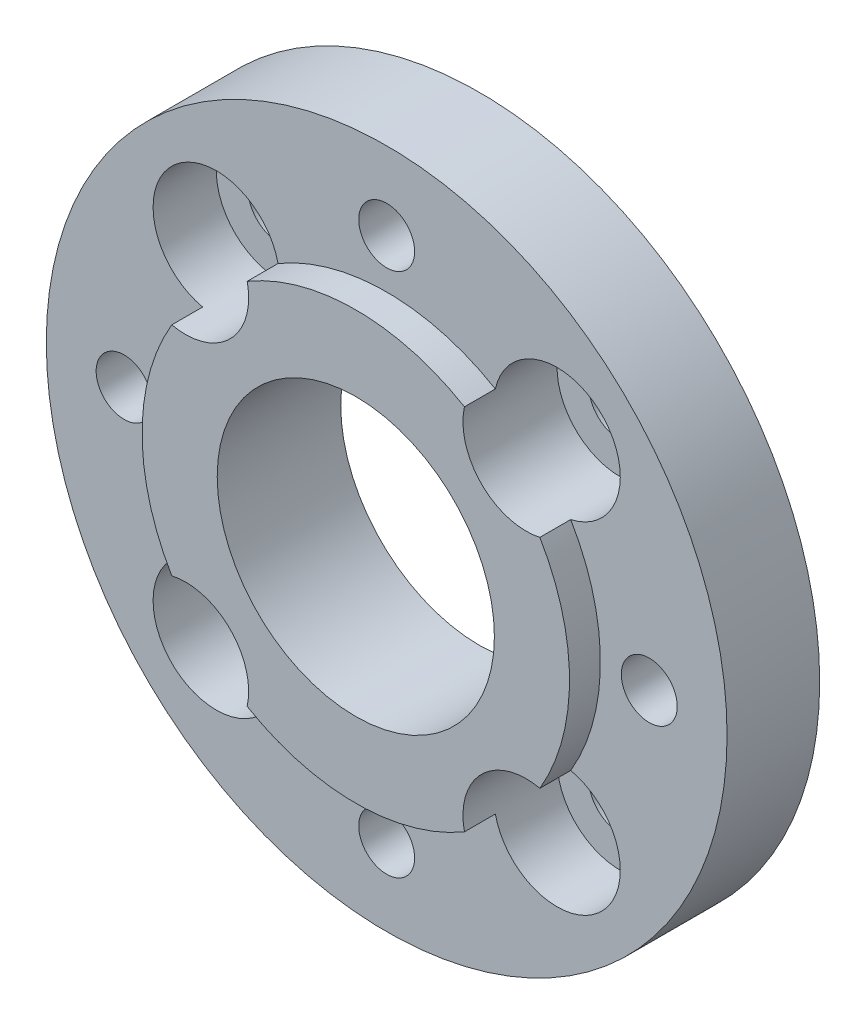
ISO-10303-21;
HEADER;
FILE_DESCRIPTION(('STEP AP214'),'2;1');
FILE_NAME('part.step','',(''),(''),'','','');
FILE_SCHEMA(('AUTOMOTIVE_DESIGN { 1 0 10303 214 1 1 1 1 }'));
ENDSEC;
DATA;
#1=APPLICATION_CONTEXT('core data for automotive mechanical design processes');
#2=APPLICATION_PROTOCOL_DEFINITION('international standard','automotive_design',2000,#1);
#3=PRODUCT_CONTEXT('',#1,'mechanical');
#4=PRODUCT('Part','Part','',(#3));
#5=PRODUCT_RELATED_PRODUCT_CATEGORY('part','',(#4));
#6=PRODUCT_DEFINITION_FORMATION('','',#4);
#7=PRODUCT_DEFINITION_CONTEXT('part definition',#1,'design');
#8=PRODUCT_DEFINITION('design','',#6,#7);
#9=PRODUCT_DEFINITION_SHAPE('','',#8);
#10=(LENGTH_UNIT() NAMED_UNIT(*) SI_UNIT(.MILLI.,.METRE.));
#11=(NAMED_UNIT(*) PLANE_ANGLE_UNIT() SI_UNIT($,.RADIAN.));
#12=(NAMED_UNIT(*) SI_UNIT($,.STERADIAN.) SOLID_ANGLE_UNIT());
#13=UNCERTAINTY_MEASURE_WITH_UNIT(LENGTH_MEASURE(1.E-05),#10,'distance_accuracy_value','');
#14=(GEOMETRIC_REPRESENTATION_CONTEXT(3) GLOBAL_UNCERTAINTY_ASSIGNED_CONTEXT((#13)) GLOBAL_UNIT_ASSIGNED_CONTEXT((#10,
#11,#12)) REPRESENTATION_CONTEXT('',''));
#15=CARTESIAN_POINT('',(0.,0.,0.));
#16=DIRECTION('',(0.,0.,1.));
#17=DIRECTION('',(1.,0.,0.));
#18=AXIS2_PLACEMENT_3D('',#15,#16,#17);
#19=CARTESIAN_POINT('',(35.0371410077935,-35.0371410077936,-19.05));
#20=DIRECTION('',(0.,0.,1.));
#21=DIRECTION('',(1.,0.,0.));
#22=AXIS2_PLACEMENT_3D('',#19,#20,#21);
#23=CYLINDRICAL_SURFACE('',#22,6.50000000000231);
#24=CARTESIAN_POINT('',(35.0371410077935,-35.0371410077936,-19.05));
#25=DIRECTION('',(0.,0.,1.));
#26=DIRECTION('',(1.,0.,0.));
#27=AXIS2_PLACEMENT_3D('',#24,#25,#26);
#28=CIRCLE('',#27,6.50000000000231);
#29=CARTESIAN_POINT('',(41.5371410077958,-35.0371410077936,-19.05));
#30=VERTEX_POINT('',#29);
#31=EDGE_CURVE('E590',#30,#30,#28,.T.);
#32=ORIENTED_EDGE('',*,*,#31,.F.);
#33=EDGE_LOOP('',(#32));
#34=FACE_BOUND('',#33,.T.);
#35=CARTESIAN_POINT('',(35.0371410077935,-35.0371410077936,-13.));
#36=DIRECTION('',(0.,0.,1.));
#37=DIRECTION('',(1.,0.,0.));
#38=AXIS2_PLACEMENT_3D('',#35,#36,#37);
#39=CIRCLE('',#38,6.50000000000231);
#40=CARTESIAN_POINT('',(41.5371410077958,-35.0371410077936,-13.));
#41=VERTEX_POINT('',#40);
#42=EDGE_CURVE('E41',#41,#41,#39,.F.);
#43=ORIENTED_EDGE('',*,*,#42,.F.);
#44=EDGE_LOOP('',(#43));
#45=FACE_BOUND('',#44,.T.);
#46=ADVANCED_FACE('F37',(#34,#45),#23,.F.);
#47=CARTESIAN_POINT('',(-35.0371410077955,-35.0371410077955,-19.05));
#48=DIRECTION('',(0.,0.,1.));
#49=DIRECTION('',(1.,0.,0.));
#50=AXIS2_PLACEMENT_3D('',#47,#48,#49);
#51=CYLINDRICAL_SURFACE('',#50,6.5);
#52=CARTESIAN_POINT('',(-35.0371410077955,-35.0371410077955,-19.05));
#53=DIRECTION('',(0.,0.,1.));
#54=DIRECTION('',(1.,0.,0.));
#55=AXIS2_PLACEMENT_3D('',#52,#53,#54);
#56=CIRCLE('',#55,6.5);
#57=CARTESIAN_POINT('',(-28.5371410077955,-35.0371410077955,-19.05));
#58=VERTEX_POINT('',#57);
#59=EDGE_CURVE('E586',#58,#58,#56,.T.);
#60=ORIENTED_EDGE('',*,*,#59,.F.);
#61=EDGE_LOOP('',(#60));
#62=FACE_BOUND('',#61,.T.);
#63=CARTESIAN_POINT('',(-35.0371410077955,-35.0371410077955,-13.));
#64=DIRECTION('',(0.,0.,1.));
#65=DIRECTION('',(1.,0.,0.));
#66=AXIS2_PLACEMENT_3D('',#63,#64,#65);
#67=CIRCLE('',#66,6.5);
#68=CARTESIAN_POINT('',(-28.5371410077955,-35.0371410077955,-13.));
#69=VERTEX_POINT('',#68);
#70=EDGE_CURVE('E259',#69,#69,#67,.F.);
#71=ORIENTED_EDGE('',*,*,#70,.F.);
#72=EDGE_LOOP('',(#71));
#73=FACE_BOUND('',#72,.T.);
#74=ADVANCED_FACE('F269',(#62,#73),#51,.F.);
#75=CARTESIAN_POINT('',(35.0371410077936,35.0371410077935,-19.05));
#76=DIRECTION('',(0.,0.,1.));
#77=DIRECTION('',(1.,0.,0.));
#78=AXIS2_PLACEMENT_3D('',#75,#76,#77);
#79=CYLINDRICAL_SURFACE('',#78,6.50000000000435);
#80=CARTESIAN_POINT('',(35.0371410077936,35.0371410077935,-19.05));
#81=DIRECTION('',(0.,0.,1.));
#82=DIRECTION('',(1.,0.,0.));
#83=AXIS2_PLACEMENT_3D('',#80,#81,#82);
#84=CIRCLE('',#83,6.50000000000435);
#85=CARTESIAN_POINT('',(41.537141007798,35.0371410077935,-19.05));
#86=VERTEX_POINT('',#85);
#87=EDGE_CURVE('E587',#86,#86,#84,.T.);
#88=ORIENTED_EDGE('',*,*,#87,.F.);
#89=EDGE_LOOP('',(#88));
#90=FACE_BOUND('',#89,.T.);
#91=CARTESIAN_POINT('',(35.0371410077936,35.0371410077935,-13.));
#92=DIRECTION('',(0.,0.,1.));
#93=DIRECTION('',(1.,0.,0.));
#94=AXIS2_PLACEMENT_3D('',#91,#92,#93);
#95=CIRCLE('',#94,6.50000000000435);
#96=CARTESIAN_POINT('',(41.537141007798,35.0371410077935,-13.));
#97=VERTEX_POINT('',#96);
#98=EDGE_CURVE('E184',#97,#97,#95,.F.);
#99=ORIENTED_EDGE('',*,*,#98,.F.);
#100=EDGE_LOOP('',(#99));
#101=FACE_BOUND('',#100,.T.);
#102=ADVANCED_FACE('F275',(#90,#101),#79,.F.);
#103=CARTESIAN_POINT('',(0.,0.,6.35));
#104=DIRECTION('',(0.,0.,-1.));
#105=DIRECTION('',(-1.,0.,0.));
#106=AXIS2_PLACEMENT_3D('',#103,#104,#105);
#107=CYLINDRICAL_SURFACE('',#106,43.95);
#108=CARTESIAN_POINT('',(0.,0.,0.));
#109=DIRECTION('',(0.,0.,1.));
#110=DIRECTION('',(1.,0.,0.));
#111=AXIS2_PLACEMENT_3D('',#108,#109,#110);
#112=CIRCLE('',#111,43.95);
#113=CARTESIAN_POINT('',(37.8462189170243,-22.3442657897876,0.));
#114=VERTEX_POINT('',#113);
#115=CARTESIAN_POINT('',(37.8462189170245,22.3442657897874,0.));
#116=VERTEX_POINT('',#115);
#117=EDGE_CURVE('E227',#114,#116,#112,.T.);
#118=ORIENTED_EDGE('',*,*,#117,.T.);
#119=DIRECTION('',(0.,0.,1.));
#120=VECTOR('',#119,1.);
#121=CARTESIAN_POINT('',(37.8462189170245,22.3442657897874,-3.325));
#122=LINE('',#121,#120);
#123=CARTESIAN_POINT('',(37.8462189170245,22.3442657897874,6.35));
#124=VERTEX_POINT('',#123);
#125=EDGE_CURVE('E12',#116,#124,#122,.T.);
#126=ORIENTED_EDGE('',*,*,#125,.T.);
#127=CARTESIAN_POINT('',(0.,0.,6.35));
#128=DIRECTION('',(0.,0.,1.));
#129=DIRECTION('',(1.,0.,0.));
#130=AXIS2_PLACEMENT_3D('',#127,#128,#129);
#131=CIRCLE('',#130,43.95);
#132=CARTESIAN_POINT('',(37.8462189170243,-22.3442657897876,6.35));
#133=VERTEX_POINT('',#132);
#134=EDGE_CURVE('E136',#133,#124,#131,.T.);
#135=ORIENTED_EDGE('',*,*,#134,.F.);
#136=DIRECTION('',(0.,0.,1.));
#137=VECTOR('',#136,1.);
#138=CARTESIAN_POINT('',(37.8462189170243,-22.3442657897876,-3.325));
#139=LINE('',#138,#137);
#140=EDGE_CURVE('E121',#133,#114,#139,.F.);
#141=ORIENTED_EDGE('',*,*,#140,.T.);
#142=EDGE_LOOP('',(#118,#126,#135,#141));
#143=FACE_BOUND('',#142,.T.);
#144=ADVANCED_FACE('F348',(#143),#107,.T.);
#145=CARTESIAN_POINT('',(-22.344265789788,-37.8462189170241,0.));
#146=VERTEX_POINT('',#145);
#147=CARTESIAN_POINT('',(22.3442657897875,-37.8462189170244,0.));
#148=VERTEX_POINT('',#147);
#149=EDGE_CURVE('E224',#146,#148,#112,.T.);
#150=ORIENTED_EDGE('',*,*,#149,.T.);
#151=DIRECTION('',(0.,0.,1.));
#152=VECTOR('',#151,1.);
#153=CARTESIAN_POINT('',(22.3442657897875,-37.8462189170244,-3.325));
#154=LINE('',#153,#152);
#155=CARTESIAN_POINT('',(22.3442657897875,-37.8462189170244,6.35));
#156=VERTEX_POINT('',#155);
#157=EDGE_CURVE('E218',#148,#156,#154,.T.);
#158=ORIENTED_EDGE('',*,*,#157,.T.);
#159=CARTESIAN_POINT('',(-22.344265789788,-37.8462189170241,6.35));
#160=VERTEX_POINT('',#159);
#161=EDGE_CURVE('E130',#160,#156,#131,.T.);
#162=ORIENTED_EDGE('',*,*,#161,.F.);
#163=DIRECTION('',(0.,0.,1.));
#164=VECTOR('',#163,1.);
#165=CARTESIAN_POINT('',(-22.344265789788,-37.8462189170241,-3.325));
#166=LINE('',#165,#164);
#167=EDGE_CURVE('E106',#160,#146,#166,.F.);
#168=ORIENTED_EDGE('',*,*,#167,.T.);
#169=EDGE_LOOP('',(#150,#158,#162,#168));
#170=FACE_BOUND('',#169,.T.);
#171=ADVANCED_FACE('F503',(#170),#107,.T.);
#172=CARTESIAN_POINT('',(-37.8462189170243,22.3442657897876,0.));
#173=VERTEX_POINT('',#172);
#174=CARTESIAN_POINT('',(-37.8462189170246,-22.3442657897871,0.));
#175=VERTEX_POINT('',#174);
#176=EDGE_CURVE('E120',#173,#175,#112,.T.);
#177=ORIENTED_EDGE('',*,*,#176,.T.);
#178=DIRECTION('',(0.,0.,1.));
#179=VECTOR('',#178,1.);
#180=CARTESIAN_POINT('',(-37.8462189170246,-22.3442657897871,-3.325));
#181=LINE('',#180,#179);
#182=CARTESIAN_POINT('',(-37.8462189170246,-22.3442657897871,6.35));
#183=VERTEX_POINT('',#182);
#184=EDGE_CURVE('E105',#175,#183,#181,.T.);
#185=ORIENTED_EDGE('',*,*,#184,.T.);
#186=CARTESIAN_POINT('',(-37.8462189170243,22.3442657897876,6.35));
#187=VERTEX_POINT('',#186);
#188=EDGE_CURVE('E118',#187,#183,#131,.T.);
#189=ORIENTED_EDGE('',*,*,#188,.F.);
#190=DIRECTION('',(0.,0.,1.));
#191=VECTOR('',#190,1.);
#192=CARTESIAN_POINT('',(-37.8462189170243,22.3442657897876,-3.325));
#193=LINE('',#192,#191);
#194=EDGE_CURVE('E223',#187,#173,#193,.F.);
#195=ORIENTED_EDGE('',*,*,#194,.T.);
#196=EDGE_LOOP('',(#177,#185,#189,#195));
#197=FACE_BOUND('',#196,.T.);
#198=ADVANCED_FACE('F116',(#197),#107,.T.);
#199=CARTESIAN_POINT('',(-35.0371410077935,35.0371410077936,-19.05));
#200=DIRECTION('',(0.,0.,1.));
#201=DIRECTION('',(1.,0.,0.));
#202=AXIS2_PLACEMENT_3D('',#199,#200,#201);
#203=CYLINDRICAL_SURFACE('',#202,6.49999999999769);
#204=CARTESIAN_POINT('',(-35.0371410077935,35.0371410077936,-19.05));
#205=DIRECTION('',(0.,0.,1.));
#206=DIRECTION('',(1.,0.,0.));
#207=AXIS2_PLACEMENT_3D('',#204,#205,#206);
#208=CIRCLE('',#207,6.49999999999769);
#209=CARTESIAN_POINT('',(-28.5371410077958,35.0371410077936,-19.05));
#210=VERTEX_POINT('',#209);
#211=EDGE_CURVE('E582',#210,#210,#208,.T.);
#212=ORIENTED_EDGE('',*,*,#211,.F.);
#213=EDGE_LOOP('',(#212));
#214=FACE_BOUND('',#213,.T.);
#215=CARTESIAN_POINT('',(-35.0371410077935,35.0371410077936,-13.));
#216=DIRECTION('',(0.,0.,1.));
#217=DIRECTION('',(1.,0.,0.));
#218=AXIS2_PLACEMENT_3D('',#215,#216,#217);
#219=CIRCLE('',#218,6.49999999999769);
#220=CARTESIAN_POINT('',(-28.5371410077958,35.0371410077936,-13.));
#221=VERTEX_POINT('',#220);
#222=EDGE_CURVE('E163',#221,#221,#219,.F.);
#223=ORIENTED_EDGE('',*,*,#222,.F.);
#224=EDGE_LOOP('',(#223));
#225=FACE_BOUND('',#224,.T.);
#226=ADVANCED_FACE('F514',(#214,#225),#203,.F.);
#227=CARTESIAN_POINT('',(0.,0.,-19.05));
#228=DIRECTION('',(0.,0.,1.));
#229=DIRECTION('',(1.,0.,0.));
#230=AXIS2_PLACEMENT_3D('',#227,#228,#229);
#231=CYLINDRICAL_SURFACE('',#230,70.);
#232=CARTESIAN_POINT('',(0.,0.,-19.05));
#233=DIRECTION('',(0.,0.,1.));
#234=DIRECTION('',(1.,0.,0.));
#235=AXIS2_PLACEMENT_3D('',#232,#233,#234);
#236=CIRCLE('',#235,70.);
#237=CARTESIAN_POINT('',(70.,0.,-19.05));
#238=VERTEX_POINT('',#237);
#239=EDGE_CURVE('E232',#238,#238,#236,.T.);
#240=ORIENTED_EDGE('',*,*,#239,.T.);
#241=EDGE_LOOP('',(#240));
#242=FACE_BOUND('',#241,.T.);
#243=CARTESIAN_POINT('',(0.,0.,0.));
#244=DIRECTION('',(0.,0.,1.));
#245=DIRECTION('',(1.,0.,0.));
#246=AXIS2_PLACEMENT_3D('',#243,#244,#245);
#247=CIRCLE('',#246,70.);
#248=CARTESIAN_POINT('',(70.,0.,0.));
#249=VERTEX_POINT('',#248);
#250=EDGE_CURVE('E235',#249,#249,#247,.T.);
#251=ORIENTED_EDGE('',*,*,#250,.F.);
#252=EDGE_LOOP('',(#251));
#253=FACE_BOUND('',#252,.T.);
#254=ADVANCED_FACE('F39',(#242,#253),#231,.T.);
#255=CARTESIAN_POINT('',(0.,0.,-19.05));
#256=DIRECTION('',(0.,0.,1.));
#257=DIRECTION('',(1.,0.,0.));
#258=AXIS2_PLACEMENT_3D('',#255,#256,#257);
#259=PLANE('',#258);
#260=CARTESIAN_POINT('',(-54.,-1.88539992297529E-13,-19.05));
#261=DIRECTION('',(0.,0.,-1.));
#262=DIRECTION('',(0.,-1.,0.));
#263=AXIS2_PLACEMENT_3D('',#260,#261,#262);
#264=CIRCLE('',#263,8.75);
#265=CARTESIAN_POINT('',(-54.,-8.75000000000019,-19.05));
#266=VERTEX_POINT('',#265);
#267=EDGE_CURVE('E167',#266,#266,#264,.T.);
#268=ORIENTED_EDGE('',*,*,#267,.F.);
#269=EDGE_LOOP('',(#268));
#270=FACE_BOUND('',#269,.T.);
#271=CARTESIAN_POINT('',(0.,-54.,-19.05));
#272=DIRECTION('',(0.,0.,-1.));
#273=DIRECTION('',(1.,0.,0.));
#274=AXIS2_PLACEMENT_3D('',#271,#272,#273);
#275=CIRCLE('',#274,8.75);
#276=CARTESIAN_POINT('',(8.75,-54.,-19.05));
#277=VERTEX_POINT('',#276);
#278=EDGE_CURVE('E159',#277,#277,#275,.T.);
#279=ORIENTED_EDGE('',*,*,#278,.F.);
#280=EDGE_LOOP('',(#279));
#281=FACE_BOUND('',#280,.T.);
#282=CARTESIAN_POINT('',(54.,5.65619976892588E-13,-19.05));
#283=DIRECTION('',(0.,0.,-1.));
#284=DIRECTION('',(0.,1.,0.));
#285=AXIS2_PLACEMENT_3D('',#282,#283,#284);
#286=CIRCLE('',#285,8.75);
#287=CARTESIAN_POINT('',(53.9999999999999,8.75000000000057,-19.05));
#288=VERTEX_POINT('',#287);
#289=EDGE_CURVE('E160',#288,#288,#286,.T.);
#290=ORIENTED_EDGE('',*,*,#289,.F.);
#291=EDGE_LOOP('',(#290));
#292=FACE_BOUND('',#291,.T.);
#293=CARTESIAN_POINT('',(0.,54.,-19.05));
#294=DIRECTION('',(0.,0.,-1.));
#295=DIRECTION('',(-1.,0.,0.));
#296=AXIS2_PLACEMENT_3D('',#293,#294,#295);
#297=CIRCLE('',#296,8.75);
#298=CARTESIAN_POINT('',(-8.75,54.,-19.05));
#299=VERTEX_POINT('',#298);
#300=EDGE_CURVE('E152',#299,#299,#297,.T.);
#301=ORIENTED_EDGE('',*,*,#300,.F.);
#302=EDGE_LOOP('',(#301));
#303=FACE_BOUND('',#302,.T.);
#304=ORIENTED_EDGE('',*,*,#87,.T.);
#305=EDGE_LOOP('',(#304));
#306=FACE_BOUND('',#305,.T.);
#307=ORIENTED_EDGE('',*,*,#211,.T.);
#308=EDGE_LOOP('',(#307));
#309=FACE_BOUND('',#308,.T.);
#310=ORIENTED_EDGE('',*,*,#59,.T.);
#311=EDGE_LOOP('',(#310));
#312=FACE_BOUND('',#311,.T.);
#313=ORIENTED_EDGE('',*,*,#31,.T.);
#314=EDGE_LOOP('',(#313));
#315=FACE_BOUND('',#314,.T.);
#316=CARTESIAN_POINT('',(0.,0.,-19.05));
#317=DIRECTION('',(0.,0.,1.));
#318=DIRECTION('',(1.,0.,0.));
#319=AXIS2_PLACEMENT_3D('',#316,#317,#318);
#320=CIRCLE('',#319,28.5);
#321=CARTESIAN_POINT('',(28.5,0.,-19.05));
#322=VERTEX_POINT('',#321);
#323=EDGE_CURVE('E240',#322,#322,#320,.T.);
#324=ORIENTED_EDGE('',*,*,#323,.T.);
#325=EDGE_LOOP('',(#324));
#326=FACE_BOUND('',#325,.T.);
#327=ORIENTED_EDGE('',*,*,#239,.F.);
#328=EDGE_LOOP('',(#327));
#329=FACE_BOUND('',#328,.T.);
#330=ADVANCED_FACE('F286',(#270,#281,#292,#303,#306,#309,#312,#315,#326,#329),#259,.F.);
#331=CARTESIAN_POINT('',(0.,0.,0.));
#332=DIRECTION('',(0.,0.,1.));
#333=DIRECTION('',(1.,0.,0.));
#334=AXIS2_PLACEMENT_3D('',#331,#332,#333);
#335=PLANE('',#334);
#336=CARTESIAN_POINT('',(35.0371410077938,35.0371410077934,0.));
#337=DIRECTION('',(0.,0.,1.));
#338=DIRECTION('',(1.,0.,0.));
#339=AXIS2_PLACEMENT_3D('',#336,#337,#338);
#340=CIRCLE('',#339,13.);
#341=CARTESIAN_POINT('',(22.3442657897877,37.8462189170242,0.));
#342=VERTEX_POINT('',#341);
#343=EDGE_CURVE('E182',#116,#342,#340,.T.);
#344=ORIENTED_EDGE('',*,*,#343,.F.);
#345=ORIENTED_EDGE('',*,*,#117,.F.);
#346=CARTESIAN_POINT('',(35.0371410077935,-35.0371410077936,0.));
#347=DIRECTION('',(0.,0.,1.));
#348=DIRECTION('',(1.,0.,0.));
#349=AXIS2_PLACEMENT_3D('',#346,#347,#348);
#350=CIRCLE('',#349,13.);
#351=EDGE_CURVE('E54',#148,#114,#350,.T.);
#352=ORIENTED_EDGE('',*,*,#351,.F.);
#353=ORIENTED_EDGE('',*,*,#149,.F.);
#354=CARTESIAN_POINT('',(-35.037141007794,-35.0371410077932,0.));
#355=DIRECTION('',(0.,0.,1.));
#356=DIRECTION('',(1.,0.,0.));
#357=AXIS2_PLACEMENT_3D('',#354,#355,#356);
#358=CIRCLE('',#357,13.);
#359=EDGE_CURVE('E62',#175,#146,#358,.T.);
#360=ORIENTED_EDGE('',*,*,#359,.F.);
#361=ORIENTED_EDGE('',*,*,#176,.F.);
#362=CARTESIAN_POINT('',(-35.0371410077935,35.0371410077936,0.));
#363=DIRECTION('',(0.,0.,1.));
#364=DIRECTION('',(1.,0.,0.));
#365=AXIS2_PLACEMENT_3D('',#362,#363,#364);
#366=CIRCLE('',#365,13.);
#367=CARTESIAN_POINT('',(-22.3442657897875,37.8462189170244,0.));
#368=VERTEX_POINT('',#367);
#369=EDGE_CURVE('E176',#368,#173,#366,.T.);
#370=ORIENTED_EDGE('',*,*,#369,.F.);
#371=EDGE_CURVE('E216',#342,#368,#112,.T.);
#372=ORIENTED_EDGE('',*,*,#371,.F.);
#373=EDGE_LOOP('',(#344,#345,#352,#353,#360,#361,#370,#372));
#374=FACE_BOUND('',#373,.T.);
#375=CARTESIAN_POINT('',(-54.,0.,0.));
#376=DIRECTION('',(0.,0.,1.));
#377=DIRECTION('',(1.,0.,0.));
#378=AXIS2_PLACEMENT_3D('',#375,#376,#377);
#379=CIRCLE('',#378,5.75);
#380=CARTESIAN_POINT('',(-48.25,0.,0.));
#381=VERTEX_POINT('',#380);
#382=EDGE_CURVE('E129',#381,#381,#379,.T.);
#383=ORIENTED_EDGE('',*,*,#382,.F.);
#384=EDGE_LOOP('',(#383));
#385=FACE_BOUND('',#384,.T.);
#386=CARTESIAN_POINT('',(0.,-54.,0.));
#387=DIRECTION('',(0.,0.,1.));
#388=DIRECTION('',(1.,0.,0.));
#389=AXIS2_PLACEMENT_3D('',#386,#387,#388);
#390=CIRCLE('',#389,5.75);
#391=CARTESIAN_POINT('',(5.75,-54.,0.));
#392=VERTEX_POINT('',#391);
#393=EDGE_CURVE('E134',#392,#392,#390,.T.);
#394=ORIENTED_EDGE('',*,*,#393,.F.);
#395=EDGE_LOOP('',(#394));
#396=FACE_BOUND('',#395,.T.);
#397=CARTESIAN_POINT('',(54.,0.,0.));
#398=DIRECTION('',(0.,0.,1.));
#399=DIRECTION('',(1.,0.,0.));
#400=AXIS2_PLACEMENT_3D('',#397,#398,#399);
#401=CIRCLE('',#400,5.75);
#402=CARTESIAN_POINT('',(59.75,0.,0.));
#403=VERTEX_POINT('',#402);
#404=EDGE_CURVE('E604',#403,#403,#401,.T.);
#405=ORIENTED_EDGE('',*,*,#404,.F.);
#406=EDGE_LOOP('',(#405));
#407=FACE_BOUND('',#406,.T.);
#408=CARTESIAN_POINT('',(0.,54.,0.));
#409=DIRECTION('',(0.,0.,1.));
#410=DIRECTION('',(1.,0.,0.));
#411=AXIS2_PLACEMENT_3D('',#408,#409,#410);
#412=CIRCLE('',#411,5.75);
#413=CARTESIAN_POINT('',(5.75,54.,0.));
#414=VERTEX_POINT('',#413);
#415=EDGE_CURVE('E593',#414,#414,#412,.T.);
#416=ORIENTED_EDGE('',*,*,#415,.F.);
#417=EDGE_LOOP('',(#416));
#418=FACE_BOUND('',#417,.T.);
#419=ORIENTED_EDGE('',*,*,#250,.T.);
#420=EDGE_LOOP('',(#419));
#421=FACE_BOUND('',#420,.T.);
#422=ADVANCED_FACE('F221',(#374,#385,#396,#407,#418,#421),#335,.T.);
#423=CARTESIAN_POINT('',(0.,0.,-19.05));
#424=DIRECTION('',(0.,0.,1.));
#425=DIRECTION('',(1.,0.,0.));
#426=AXIS2_PLACEMENT_3D('',#423,#424,#425);
#427=CYLINDRICAL_SURFACE('',#426,28.5);
#428=ORIENTED_EDGE('',*,*,#323,.F.);
#429=EDGE_LOOP('',(#428));
#430=FACE_BOUND('',#429,.T.);
#431=CARTESIAN_POINT('',(0.,0.,6.35));
#432=DIRECTION('',(0.,0.,1.));
#433=DIRECTION('',(1.,0.,0.));
#434=AXIS2_PLACEMENT_3D('',#431,#432,#433);
#435=CIRCLE('',#434,28.5);
#436=CARTESIAN_POINT('',(28.5,0.,6.35));
#437=VERTEX_POINT('',#436);
#438=EDGE_CURVE('E139',#437,#437,#435,.T.);
#439=ORIENTED_EDGE('',*,*,#438,.T.);
#440=EDGE_LOOP('',(#439));
#441=FACE_BOUND('',#440,.T.);
#442=ADVANCED_FACE('F281',(#430,#441),#427,.F.);
#443=CARTESIAN_POINT('',(0.,54.,-19.05));
#444=DIRECTION('',(0.,0.,1.));
#445=DIRECTION('',(1.,0.,0.));
#446=AXIS2_PLACEMENT_3D('',#443,#444,#445);
#447=CYLINDRICAL_SURFACE('',#446,5.75);
#448=CARTESIAN_POINT('',(0.,54.,-10.));
#449=DIRECTION('',(0.,0.,1.));
#450=DIRECTION('',(1.,0.,0.));
#451=AXIS2_PLACEMENT_3D('',#448,#449,#450);
#452=CIRCLE('',#451,5.75);
#453=CARTESIAN_POINT('',(5.75,54.,-10.));
#454=VERTEX_POINT('',#453);
#455=EDGE_CURVE('E143',#454,#454,#452,.F.);
#456=ORIENTED_EDGE('',*,*,#455,.T.);
#457=EDGE_LOOP('',(#456));
#458=FACE_BOUND('',#457,.T.);
#459=ORIENTED_EDGE('',*,*,#415,.T.);
#460=EDGE_LOOP('',(#459));
#461=FACE_BOUND('',#460,.T.);
#462=ADVANCED_FACE('F284',(#458,#461),#447,.F.);
#463=CARTESIAN_POINT('',(54.,0.,-19.05));
#464=DIRECTION('',(0.,0.,1.));
#465=DIRECTION('',(1.,0.,0.));
#466=AXIS2_PLACEMENT_3D('',#463,#464,#465);
#467=CYLINDRICAL_SURFACE('',#466,5.75);
#468=CARTESIAN_POINT('',(54.,0.,-10.));
#469=DIRECTION('',(0.,0.,1.));
#470=DIRECTION('',(1.,0.,0.));
#471=AXIS2_PLACEMENT_3D('',#468,#469,#470);
#472=CIRCLE('',#471,5.75);
#473=CARTESIAN_POINT('',(59.75,0.,-10.));
#474=VERTEX_POINT('',#473);
#475=EDGE_CURVE('E155',#474,#474,#472,.F.);
#476=ORIENTED_EDGE('',*,*,#475,.T.);
#477=EDGE_LOOP('',(#476));
#478=FACE_BOUND('',#477,.T.);
#479=ORIENTED_EDGE('',*,*,#404,.T.);
#480=EDGE_LOOP('',(#479));
#481=FACE_BOUND('',#480,.T.);
#482=ADVANCED_FACE('F308',(#478,#481),#467,.F.);
#483=CARTESIAN_POINT('',(0.,-54.,-19.05));
#484=DIRECTION('',(0.,0.,1.));
#485=DIRECTION('',(1.,0.,0.));
#486=AXIS2_PLACEMENT_3D('',#483,#484,#485);
#487=CYLINDRICAL_SURFACE('',#486,5.75);
#488=CARTESIAN_POINT('',(0.,-54.,-10.));
#489=DIRECTION('',(0.,0.,1.));
#490=DIRECTION('',(1.,0.,0.));
#491=AXIS2_PLACEMENT_3D('',#488,#489,#490);
#492=CIRCLE('',#491,5.75);
#493=CARTESIAN_POINT('',(5.75,-54.,-10.));
#494=VERTEX_POINT('',#493);
#495=EDGE_CURVE('E247',#494,#494,#492,.F.);
#496=ORIENTED_EDGE('',*,*,#495,.T.);
#497=EDGE_LOOP('',(#496));
#498=FACE_BOUND('',#497,.T.);
#499=ORIENTED_EDGE('',*,*,#393,.T.);
#500=EDGE_LOOP('',(#499));
#501=FACE_BOUND('',#500,.T.);
#502=ADVANCED_FACE('F317',(#498,#501),#487,.F.);
#503=CARTESIAN_POINT('',(-54.,0.,-19.05));
#504=DIRECTION('',(0.,0.,1.));
#505=DIRECTION('',(1.,0.,0.));
#506=AXIS2_PLACEMENT_3D('',#503,#504,#505);
#507=CYLINDRICAL_SURFACE('',#506,5.75);
#508=CARTESIAN_POINT('',(-54.,0.,-10.));
#509=DIRECTION('',(0.,0.,1.));
#510=DIRECTION('',(1.,0.,0.));
#511=AXIS2_PLACEMENT_3D('',#508,#509,#510);
#512=CIRCLE('',#511,5.75);
#513=CARTESIAN_POINT('',(-48.25,0.,-10.));
#514=VERTEX_POINT('',#513);
#515=EDGE_CURVE('E173',#514,#514,#512,.F.);
#516=ORIENTED_EDGE('',*,*,#515,.T.);
#517=EDGE_LOOP('',(#516));
#518=FACE_BOUND('',#517,.T.);
#519=ORIENTED_EDGE('',*,*,#382,.T.);
#520=EDGE_LOOP('',(#519));
#521=FACE_BOUND('',#520,.T.);
#522=ADVANCED_FACE('F325',(#518,#521),#507,.F.);
#523=CARTESIAN_POINT('',(0.,0.,6.35));
#524=DIRECTION('',(0.,0.,1.));
#525=DIRECTION('',(1.,0.,0.));
#526=AXIS2_PLACEMENT_3D('',#523,#524,#525);
#527=PLANE('',#526);
#528=CARTESIAN_POINT('',(35.0371410077938,35.0371410077934,6.35));
#529=DIRECTION('',(0.,0.,1.));
#530=DIRECTION('',(0.,-1.,0.));
#531=AXIS2_PLACEMENT_3D('',#528,#529,#530);
#532=CIRCLE('',#531,13.);
#533=CARTESIAN_POINT('',(22.3442657897877,37.8462189170242,6.35));
#534=VERTEX_POINT('',#533);
#535=EDGE_CURVE('E195',#534,#124,#532,.T.);
#536=ORIENTED_EDGE('',*,*,#535,.F.);
#537=CARTESIAN_POINT('',(-22.3442657897875,37.8462189170244,6.35));
#538=VERTEX_POINT('',#537);
#539=EDGE_CURVE('E132',#534,#538,#131,.T.);
#540=ORIENTED_EDGE('',*,*,#539,.T.);
#541=CARTESIAN_POINT('',(-35.0371410077935,35.0371410077936,6.35));
#542=DIRECTION('',(0.,0.,1.));
#543=DIRECTION('',(1.,0.,0.));
#544=AXIS2_PLACEMENT_3D('',#541,#542,#543);
#545=CIRCLE('',#544,13.);
#546=EDGE_CURVE('E128',#187,#538,#545,.T.);
#547=ORIENTED_EDGE('',*,*,#546,.F.);
#548=ORIENTED_EDGE('',*,*,#188,.T.);
#549=CARTESIAN_POINT('',(-35.037141007794,-35.0371410077932,6.35));
#550=DIRECTION('',(0.,0.,1.));
#551=DIRECTION('',(0.,1.,0.));
#552=AXIS2_PLACEMENT_3D('',#549,#550,#551);
#553=CIRCLE('',#552,13.);
#554=EDGE_CURVE('E102',#160,#183,#553,.T.);
#555=ORIENTED_EDGE('',*,*,#554,.F.);
#556=ORIENTED_EDGE('',*,*,#161,.T.);
#557=CARTESIAN_POINT('',(35.0371410077935,-35.0371410077936,6.35));
#558=DIRECTION('',(0.,0.,1.));
#559=DIRECTION('',(-1.,0.,0.));
#560=AXIS2_PLACEMENT_3D('',#557,#558,#559);
#561=CIRCLE('',#560,13.);
#562=EDGE_CURVE('E190',#133,#156,#561,.T.);
#563=ORIENTED_EDGE('',*,*,#562,.F.);
#564=ORIENTED_EDGE('',*,*,#134,.T.);
#565=EDGE_LOOP('',(#536,#540,#547,#548,#555,#556,#563,#564));
#566=FACE_BOUND('',#565,.T.);
#567=ORIENTED_EDGE('',*,*,#438,.F.);
#568=EDGE_LOOP('',(#567));
#569=FACE_BOUND('',#568,.T.);
#570=ADVANCED_FACE('F125',(#566,#569),#527,.T.);
#571=ORIENTED_EDGE('',*,*,#539,.F.);
#572=DIRECTION('',(0.,0.,1.));
#573=VECTOR('',#572,1.);
#574=CARTESIAN_POINT('',(22.3442657897877,37.8462189170242,-3.325));
#575=LINE('',#574,#573);
#576=EDGE_CURVE('E46',#534,#342,#575,.F.);
#577=ORIENTED_EDGE('',*,*,#576,.T.);
#578=ORIENTED_EDGE('',*,*,#371,.T.);
#579=DIRECTION('',(0.,0.,1.));
#580=VECTOR('',#579,1.);
#581=CARTESIAN_POINT('',(-22.3442657897875,37.8462189170244,-3.325));
#582=LINE('',#581,#580);
#583=EDGE_CURVE('E225',#368,#538,#582,.T.);
#584=ORIENTED_EDGE('',*,*,#583,.T.);
#585=EDGE_LOOP('',(#571,#577,#578,#584));
#586=FACE_BOUND('',#585,.T.);
#587=ADVANCED_FACE('F214',(#586),#107,.T.);
#588=CARTESIAN_POINT('',(0.,0.,-10.));
#589=DIRECTION('',(0.,0.,1.));
#590=DIRECTION('',(1.,0.,0.));
#591=AXIS2_PLACEMENT_3D('',#588,#589,#590);
#592=PLANE('',#591);
#593=CARTESIAN_POINT('',(0.,54.,-10.));
#594=DIRECTION('',(0.,0.,1.));
#595=DIRECTION('',(1.,0.,0.));
#596=AXIS2_PLACEMENT_3D('',#593,#594,#595);
#597=CIRCLE('',#596,8.75);
#598=CARTESIAN_POINT('',(8.75,54.,-10.));
#599=VERTEX_POINT('',#598);
#600=EDGE_CURVE('E147',#599,#599,#597,.F.);
#601=ORIENTED_EDGE('',*,*,#600,.T.);
#602=EDGE_LOOP('',(#601));
#603=FACE_BOUND('',#602,.T.);
#604=ORIENTED_EDGE('',*,*,#455,.F.);
#605=EDGE_LOOP('',(#604));
#606=FACE_BOUND('',#605,.T.);
#607=ADVANCED_FACE('F346',(#603,#606),#592,.F.);
#608=CARTESIAN_POINT('',(0.,54.,24.7487373415292));
#609=DIRECTION('',(0.,0.,-1.));
#610=DIRECTION('',(-1.,0.,0.));
#611=AXIS2_PLACEMENT_3D('',#608,#609,#610);
#612=CYLINDRICAL_SURFACE('',#611,8.75);
#613=ORIENTED_EDGE('',*,*,#300,.T.);
#614=EDGE_LOOP('',(#613));
#615=FACE_BOUND('',#614,.T.);
#616=ORIENTED_EDGE('',*,*,#600,.F.);
#617=EDGE_LOOP('',(#616));
#618=FACE_BOUND('',#617,.T.);
#619=ADVANCED_FACE('F354',(#615,#618),#612,.F.);
#620=CARTESIAN_POINT('',(0.,0.,-10.));
#621=DIRECTION('',(0.,0.,1.));
#622=DIRECTION('',(1.,0.,0.));
#623=AXIS2_PLACEMENT_3D('',#620,#621,#622);
#624=PLANE('',#623);
#625=CARTESIAN_POINT('',(-54.,-1.88539992297529E-13,-10.));
#626=DIRECTION('',(0.,0.,1.));
#627=DIRECTION('',(1.,0.,0.));
#628=AXIS2_PLACEMENT_3D('',#625,#626,#627);
#629=CIRCLE('',#628,8.75);
#630=CARTESIAN_POINT('',(-45.25,-1.88539992297529E-13,-10.));
#631=VERTEX_POINT('',#630);
#632=EDGE_CURVE('E170',#631,#631,#629,.F.);
#633=ORIENTED_EDGE('',*,*,#632,.T.);
#634=EDGE_LOOP('',(#633));
#635=FACE_BOUND('',#634,.T.);
#636=ORIENTED_EDGE('',*,*,#515,.F.);
#637=EDGE_LOOP('',(#636));
#638=FACE_BOUND('',#637,.T.);
#639=ADVANCED_FACE('F362',(#635,#638),#624,.F.);
#640=CARTESIAN_POINT('',(-54.,-1.88539992297529E-13,24.7487373415292));
#641=DIRECTION('',(0.,0.,-1.));
#642=DIRECTION('',(-1.,0.,0.));
#643=AXIS2_PLACEMENT_3D('',#640,#641,#642);
#644=CYLINDRICAL_SURFACE('',#643,8.75);
#645=ORIENTED_EDGE('',*,*,#267,.T.);
#646=EDGE_LOOP('',(#645));
#647=FACE_BOUND('',#646,.T.);
#648=ORIENTED_EDGE('',*,*,#632,.F.);
#649=EDGE_LOOP('',(#648));
#650=FACE_BOUND('',#649,.T.);
#651=ADVANCED_FACE('F369',(#647,#650),#644,.F.);
#652=CARTESIAN_POINT('',(0.,0.,-10.));
#653=DIRECTION('',(0.,0.,1.));
#654=DIRECTION('',(1.,0.,0.));
#655=AXIS2_PLACEMENT_3D('',#652,#653,#654);
#656=PLANE('',#655);
#657=CARTESIAN_POINT('',(0.,-54.,-10.));
#658=DIRECTION('',(0.,0.,1.));
#659=DIRECTION('',(1.,0.,0.));
#660=AXIS2_PLACEMENT_3D('',#657,#658,#659);
#661=CIRCLE('',#660,8.75);
#662=CARTESIAN_POINT('',(8.75,-54.,-10.));
#663=VERTEX_POINT('',#662);
#664=EDGE_CURVE('E164',#663,#663,#661,.F.);
#665=ORIENTED_EDGE('',*,*,#664,.T.);
#666=EDGE_LOOP('',(#665));
#667=FACE_BOUND('',#666,.T.);
#668=ORIENTED_EDGE('',*,*,#495,.F.);
#669=EDGE_LOOP('',(#668));
#670=FACE_BOUND('',#669,.T.);
#671=ADVANCED_FACE('F377',(#667,#670),#656,.F.);
#672=CARTESIAN_POINT('',(0.,-54.,24.7487373415292));
#673=DIRECTION('',(0.,0.,-1.));
#674=DIRECTION('',(-1.,0.,0.));
#675=AXIS2_PLACEMENT_3D('',#672,#673,#674);
#676=CYLINDRICAL_SURFACE('',#675,8.75);
#677=ORIENTED_EDGE('',*,*,#278,.T.);
#678=EDGE_LOOP('',(#677));
#679=FACE_BOUND('',#678,.T.);
#680=ORIENTED_EDGE('',*,*,#664,.F.);
#681=EDGE_LOOP('',(#680));
#682=FACE_BOUND('',#681,.T.);
#683=ADVANCED_FACE('F385',(#679,#682),#676,.F.);
#684=CARTESIAN_POINT('',(0.,0.,-10.));
#685=DIRECTION('',(0.,0.,1.));
#686=DIRECTION('',(1.,0.,0.));
#687=AXIS2_PLACEMENT_3D('',#684,#685,#686);
#688=PLANE('',#687);
#689=CARTESIAN_POINT('',(54.,5.65619976892588E-13,-10.));
#690=DIRECTION('',(0.,0.,1.));
#691=DIRECTION('',(1.,0.,0.));
#692=AXIS2_PLACEMENT_3D('',#689,#690,#691);
#693=CIRCLE('',#692,8.75);
#694=CARTESIAN_POINT('',(62.75,5.65619976892588E-13,-10.));
#695=VERTEX_POINT('',#694);
#696=EDGE_CURVE('E156',#695,#695,#693,.F.);
#697=ORIENTED_EDGE('',*,*,#696,.T.);
#698=EDGE_LOOP('',(#697));
#699=FACE_BOUND('',#698,.T.);
#700=ORIENTED_EDGE('',*,*,#475,.F.);
#701=EDGE_LOOP('',(#700));
#702=FACE_BOUND('',#701,.T.);
#703=ADVANCED_FACE('F393',(#699,#702),#688,.F.);
#704=CARTESIAN_POINT('',(54.,5.65619976892588E-13,24.7487373415292));
#705=DIRECTION('',(0.,0.,-1.));
#706=DIRECTION('',(-1.,0.,0.));
#707=AXIS2_PLACEMENT_3D('',#704,#705,#706);
#708=CYLINDRICAL_SURFACE('',#707,8.75);
#709=ORIENTED_EDGE('',*,*,#289,.T.);
#710=EDGE_LOOP('',(#709));
#711=FACE_BOUND('',#710,.T.);
#712=ORIENTED_EDGE('',*,*,#696,.F.);
#713=EDGE_LOOP('',(#712));
#714=FACE_BOUND('',#713,.T.);
#715=ADVANCED_FACE('F401',(#711,#714),#708,.F.);
#716=CARTESIAN_POINT('',(-35.0371410077935,35.0371410077936,-13.));
#717=DIRECTION('',(0.,0.,1.));
#718=DIRECTION('',(1.,0.,0.));
#719=AXIS2_PLACEMENT_3D('',#716,#717,#718);
#720=PLANE('',#719);
#721=CARTESIAN_POINT('',(-35.0371410077935,35.0371410077936,-13.));
#722=DIRECTION('',(0.,0.,1.));
#723=DIRECTION('',(1.,0.,0.));
#724=AXIS2_PLACEMENT_3D('',#721,#722,#723);
#725=CIRCLE('',#724,13.);
#726=CARTESIAN_POINT('',(-22.0371410077935,35.0371410077936,-13.));
#727=VERTEX_POINT('',#726);
#728=EDGE_CURVE('E178',#727,#727,#725,.T.);
#729=ORIENTED_EDGE('',*,*,#728,.T.);
#730=EDGE_LOOP('',(#729));
#731=FACE_BOUND('',#730,.T.);
#732=ORIENTED_EDGE('',*,*,#222,.T.);
#733=EDGE_LOOP('',(#732));
#734=FACE_BOUND('',#733,.T.);
#735=ADVANCED_FACE('F409',(#731,#734),#720,.T.);
#736=CARTESIAN_POINT('',(-35.0371410077935,35.0371410077936,-13.));
#737=DIRECTION('',(0.,0.,1.));
#738=DIRECTION('',(1.,0.,0.));
#739=AXIS2_PLACEMENT_3D('',#736,#737,#738);
#740=CYLINDRICAL_SURFACE('',#739,13.);
#741=ORIENTED_EDGE('',*,*,#728,.F.);
#742=EDGE_LOOP('',(#741));
#743=FACE_BOUND('',#742,.T.);
#744=ORIENTED_EDGE('',*,*,#369,.T.);
#745=ORIENTED_EDGE('',*,*,#194,.F.);
#746=ORIENTED_EDGE('',*,*,#546,.T.);
#747=ORIENTED_EDGE('',*,*,#583,.F.);
#748=EDGE_LOOP('',(#744,#745,#746,#747));
#749=FACE_BOUND('',#748,.T.);
#750=ADVANCED_FACE('F418',(#743,#749),#740,.F.);
#751=CARTESIAN_POINT('',(-35.037141007794,-35.0371410077932,-13.));
#752=DIRECTION('',(0.,0.,1.));
#753=DIRECTION('',(0.,1.,0.));
#754=AXIS2_PLACEMENT_3D('',#751,#752,#753);
#755=PLANE('',#754);
#756=CARTESIAN_POINT('',(-35.037141007794,-35.0371410077932,-13.));
#757=DIRECTION('',(0.,0.,1.));
#758=DIRECTION('',(0.,1.,0.));
#759=AXIS2_PLACEMENT_3D('',#756,#757,#758);
#760=CIRCLE('',#759,13.);
#761=CARTESIAN_POINT('',(-35.0371410077939,-22.0371410077932,-13.));
#762=VERTEX_POINT('',#761);
#763=EDGE_CURVE('E111',#762,#762,#760,.T.);
#764=ORIENTED_EDGE('',*,*,#763,.T.);
#765=EDGE_LOOP('',(#764));
#766=FACE_BOUND('',#765,.T.);
#767=ORIENTED_EDGE('',*,*,#70,.T.);
#768=EDGE_LOOP('',(#767));
#769=FACE_BOUND('',#768,.T.);
#770=ADVANCED_FACE('F426',(#766,#769),#755,.T.);
#771=CARTESIAN_POINT('',(-35.037141007794,-35.0371410077932,-13.));
#772=DIRECTION('',(0.,0.,1.));
#773=DIRECTION('',(1.,0.,0.));
#774=AXIS2_PLACEMENT_3D('',#771,#772,#773);
#775=CYLINDRICAL_SURFACE('',#774,13.);
#776=ORIENTED_EDGE('',*,*,#763,.F.);
#777=EDGE_LOOP('',(#776));
#778=FACE_BOUND('',#777,.T.);
#779=ORIENTED_EDGE('',*,*,#359,.T.);
#780=ORIENTED_EDGE('',*,*,#167,.F.);
#781=ORIENTED_EDGE('',*,*,#554,.T.);
#782=ORIENTED_EDGE('',*,*,#184,.F.);
#783=EDGE_LOOP('',(#779,#780,#781,#782));
#784=FACE_BOUND('',#783,.T.);
#785=ADVANCED_FACE('F104',(#778,#784),#775,.F.);
#786=CARTESIAN_POINT('',(35.0371410077935,-35.0371410077936,-13.));
#787=DIRECTION('',(0.,0.,1.));
#788=DIRECTION('',(-1.,0.,0.));
#789=AXIS2_PLACEMENT_3D('',#786,#787,#788);
#790=PLANE('',#789);
#791=CARTESIAN_POINT('',(35.0371410077935,-35.0371410077936,-13.));
#792=DIRECTION('',(0.,0.,1.));
#793=DIRECTION('',(-1.,0.,0.));
#794=AXIS2_PLACEMENT_3D('',#791,#792,#793);
#795=CIRCLE('',#794,13.);
#796=CARTESIAN_POINT('',(22.0371410077935,-35.0371410077936,-13.));
#797=VERTEX_POINT('',#796);
#798=EDGE_CURVE('E192',#797,#797,#795,.T.);
#799=ORIENTED_EDGE('',*,*,#798,.T.);
#800=EDGE_LOOP('',(#799));
#801=FACE_BOUND('',#800,.T.);
#802=ORIENTED_EDGE('',*,*,#42,.T.);
#803=EDGE_LOOP('',(#802));
#804=FACE_BOUND('',#803,.T.);
#805=ADVANCED_FACE('F266',(#801,#804),#790,.T.);
#806=CARTESIAN_POINT('',(35.0371410077935,-35.0371410077936,-13.));
#807=DIRECTION('',(0.,0.,1.));
#808=DIRECTION('',(1.,0.,0.));
#809=AXIS2_PLACEMENT_3D('',#806,#807,#808);
#810=CYLINDRICAL_SURFACE('',#809,13.);
#811=ORIENTED_EDGE('',*,*,#798,.F.);
#812=EDGE_LOOP('',(#811));
#813=FACE_BOUND('',#812,.T.);
#814=ORIENTED_EDGE('',*,*,#351,.T.);
#815=ORIENTED_EDGE('',*,*,#140,.F.);
#816=ORIENTED_EDGE('',*,*,#562,.T.);
#817=ORIENTED_EDGE('',*,*,#157,.F.);
#818=EDGE_LOOP('',(#814,#815,#816,#817));
#819=FACE_BOUND('',#818,.T.);
#820=ADVANCED_FACE('F447',(#813,#819),#810,.F.);
#821=CARTESIAN_POINT('',(35.0371410077938,35.0371410077934,-13.));
#822=DIRECTION('',(0.,0.,1.));
#823=DIRECTION('',(0.,-1.,0.));
#824=AXIS2_PLACEMENT_3D('',#821,#822,#823);
#825=PLANE('',#824);
#826=CARTESIAN_POINT('',(35.0371410077938,35.0371410077934,-13.));
#827=DIRECTION('',(0.,0.,1.));
#828=DIRECTION('',(0.,-1.,0.));
#829=AXIS2_PLACEMENT_3D('',#826,#827,#828);
#830=CIRCLE('',#829,13.);
#831=CARTESIAN_POINT('',(35.0371410077937,22.0371410077934,-13.));
#832=VERTEX_POINT('',#831);
#833=EDGE_CURVE('E186',#832,#832,#830,.T.);
#834=ORIENTED_EDGE('',*,*,#833,.T.);
#835=EDGE_LOOP('',(#834));
#836=FACE_BOUND('',#835,.T.);
#837=ORIENTED_EDGE('',*,*,#98,.T.);
#838=EDGE_LOOP('',(#837));
#839=FACE_BOUND('',#838,.T.);
#840=ADVANCED_FACE('F200',(#836,#839),#825,.T.);
#841=CARTESIAN_POINT('',(35.0371410077938,35.0371410077934,-13.));
#842=DIRECTION('',(0.,0.,1.));
#843=DIRECTION('',(1.,0.,0.));
#844=AXIS2_PLACEMENT_3D('',#841,#842,#843);
#845=CYLINDRICAL_SURFACE('',#844,13.);
#846=ORIENTED_EDGE('',*,*,#833,.F.);
#847=EDGE_LOOP('',(#846));
#848=FACE_BOUND('',#847,.T.);
#849=ORIENTED_EDGE('',*,*,#343,.T.);
#850=ORIENTED_EDGE('',*,*,#576,.F.);
#851=ORIENTED_EDGE('',*,*,#535,.T.);
#852=ORIENTED_EDGE('',*,*,#125,.F.);
#853=EDGE_LOOP('',(#849,#850,#851,#852));
#854=FACE_BOUND('',#853,.T.);
#855=ADVANCED_FACE('F203',(#848,#854),#845,.F.);
#856=CLOSED_SHELL('',(#46,#74,#102,#144,#171,#198,#226,#254,#330,#422,#442,#462,#482,#502,#522,
#570,#587,#607,#619,#639,#651,#671,#683,#703,#715,#735,#750,#770,#785,#805,#820,#840,#855));
#857=MANIFOLD_SOLID_BREP('B2',#856);
#858=ADVANCED_BREP_SHAPE_REPRESENTATION('',(#18,#857),#14);
#859=SHAPE_DEFINITION_REPRESENTATION(#9,#858);
ENDSEC;
END-ISO-10303-21;
